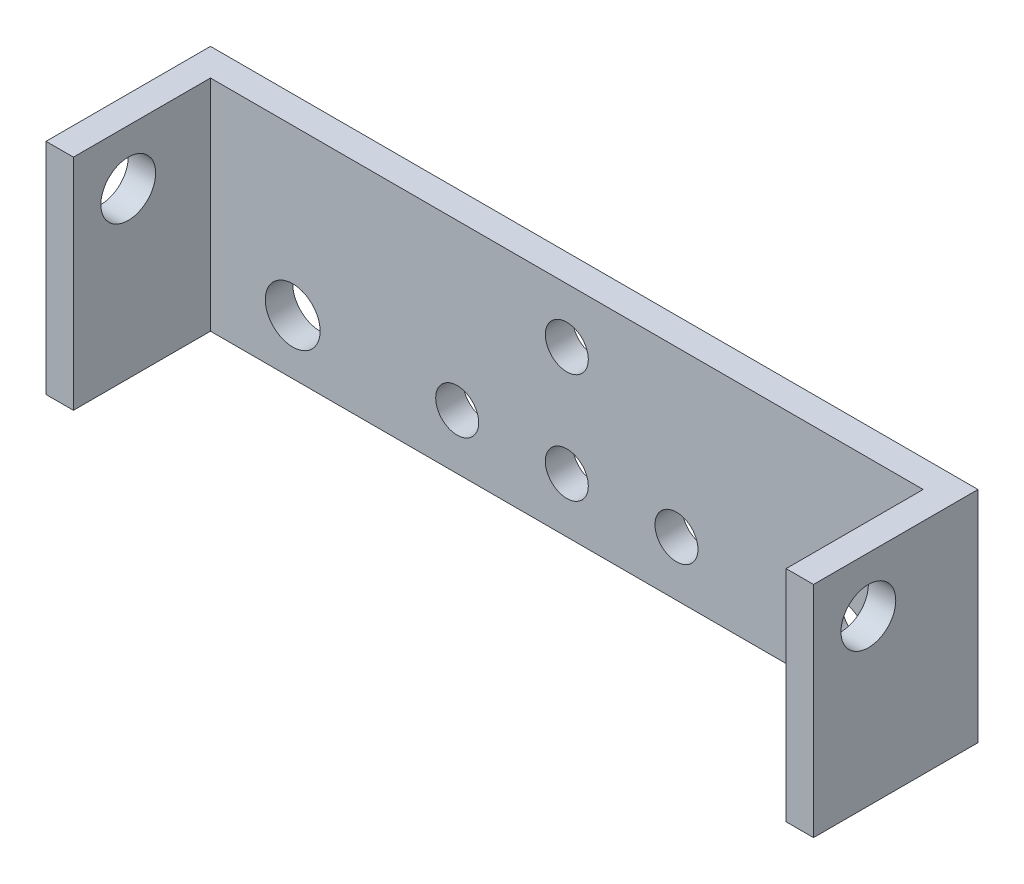
ISO-10303-21;
HEADER;
FILE_DESCRIPTION(('STEP AP214'),'2;1');
FILE_NAME('part.step','',(''),(''),'','','');
FILE_SCHEMA(('AUTOMOTIVE_DESIGN { 1 0 10303 214 1 1 1 1 }'));
ENDSEC;
DATA;
#1=APPLICATION_CONTEXT('core data for automotive mechanical design processes');
#2=APPLICATION_PROTOCOL_DEFINITION('international standard','automotive_design',2000,#1);
#3=PRODUCT_CONTEXT('',#1,'mechanical');
#4=PRODUCT('Part','Part','',(#3));
#5=PRODUCT_RELATED_PRODUCT_CATEGORY('part','',(#4));
#6=PRODUCT_DEFINITION_FORMATION('','',#4);
#7=PRODUCT_DEFINITION_CONTEXT('part definition',#1,'design');
#8=PRODUCT_DEFINITION('design','',#6,#7);
#9=PRODUCT_DEFINITION_SHAPE('','',#8);
#10=(LENGTH_UNIT() NAMED_UNIT(*) SI_UNIT(.MILLI.,.METRE.));
#11=(NAMED_UNIT(*) PLANE_ANGLE_UNIT() SI_UNIT($,.RADIAN.));
#12=(NAMED_UNIT(*) SI_UNIT($,.STERADIAN.) SOLID_ANGLE_UNIT());
#13=UNCERTAINTY_MEASURE_WITH_UNIT(LENGTH_MEASURE(1.E-05),#10,'distance_accuracy_value','');
#14=(GEOMETRIC_REPRESENTATION_CONTEXT(3) GLOBAL_UNCERTAINTY_ASSIGNED_CONTEXT((#13)) GLOBAL_UNIT_ASSIGNED_CONTEXT((#10,
#11,#12)) REPRESENTATION_CONTEXT('',''));
#15=CARTESIAN_POINT('',(0.,0.,0.));
#16=DIRECTION('',(0.,0.,1.));
#17=DIRECTION('',(1.,0.,0.));
#18=AXIS2_PLACEMENT_3D('',#15,#16,#17);
#19=CARTESIAN_POINT('',(3.17500000000001,25.4,0.));
#20=DIRECTION('',(0.,0.,-1.));
#21=DIRECTION('',(-1.,0.,0.));
#22=AXIS2_PLACEMENT_3D('',#19,#20,#21);
#23=PLANE('',#22);
#24=DIRECTION('',(1.,0.,0.));
#25=VECTOR('',#24,1.);
#26=CARTESIAN_POINT('',(3.17500000000001,0.,0.));
#27=LINE('',#26,#25);
#28=CARTESIAN_POINT('',(0.,0.,0.));
#29=VERTEX_POINT('',#28);
#30=CARTESIAN_POINT('',(3.17500000000001,0.,0.));
#31=VERTEX_POINT('',#30);
#32=EDGE_CURVE('E128',#29,#31,#27,.T.);
#33=ORIENTED_EDGE('',*,*,#32,.T.);
#34=DIRECTION('',(0.,-1.,0.));
#35=VECTOR('',#34,1.);
#36=CARTESIAN_POINT('',(3.17500000000001,25.4,0.));
#37=LINE('',#36,#35);
#38=CARTESIAN_POINT('',(3.17500000000001,25.4,0.));
#39=VERTEX_POINT('',#38);
#40=EDGE_CURVE('E11',#39,#31,#37,.T.);
#41=ORIENTED_EDGE('',*,*,#40,.F.);
#42=DIRECTION('',(1.,0.,0.));
#43=VECTOR('',#42,1.);
#44=CARTESIAN_POINT('',(3.17500000000001,25.4,0.));
#45=LINE('',#44,#43);
#46=CARTESIAN_POINT('',(0.,25.4,0.));
#47=VERTEX_POINT('',#46);
#48=EDGE_CURVE('E143',#47,#39,#45,.T.);
#49=ORIENTED_EDGE('',*,*,#48,.F.);
#50=DIRECTION('',(0.,-1.,0.));
#51=VECTOR('',#50,1.);
#52=CARTESIAN_POINT('',(0.,25.4,0.));
#53=LINE('',#52,#51);
#54=EDGE_CURVE('E124',#47,#29,#53,.T.);
#55=ORIENTED_EDGE('',*,*,#54,.T.);
#56=EDGE_LOOP('',(#33,#41,#49,#55));
#57=FACE_BOUND('',#56,.T.);
#58=ADVANCED_FACE('F32',(#57),#23,.F.);
#59=CARTESIAN_POINT('',(3.175,25.4,-15.875));
#60=DIRECTION('',(-1.,0.,0.));
#61=DIRECTION('',(0.,0.,1.));
#62=AXIS2_PLACEMENT_3D('',#59,#60,#61);
#63=PLANE('',#62);
#64=CARTESIAN_POINT('',(3.175,19.05,-6.34999999999999));
#65=DIRECTION('',(-1.,0.,0.));
#66=DIRECTION('',(0.,0.,1.));
#67=AXIS2_PLACEMENT_3D('',#64,#65,#66);
#68=CIRCLE('',#67,3.175);
#69=CARTESIAN_POINT('',(3.17500000000001,19.05,-3.17499999999999));
#70=VERTEX_POINT('',#69);
#71=EDGE_CURVE('E132',#70,#70,#68,.T.);
#72=ORIENTED_EDGE('',*,*,#71,.T.);
#73=EDGE_LOOP('',(#72));
#74=FACE_BOUND('',#73,.T.);
#75=DIRECTION('',(0.,0.,-1.));
#76=VECTOR('',#75,1.);
#77=CARTESIAN_POINT('',(3.175,0.,-15.875));
#78=LINE('',#77,#76);
#79=CARTESIAN_POINT('',(3.175,0.,-15.875));
#80=VERTEX_POINT('',#79);
#81=EDGE_CURVE('E131',#31,#80,#78,.T.);
#82=ORIENTED_EDGE('',*,*,#81,.T.);
#83=DIRECTION('',(0.,-1.,0.));
#84=VECTOR('',#83,1.);
#85=CARTESIAN_POINT('',(3.175,25.4,-15.875));
#86=LINE('',#85,#84);
#87=CARTESIAN_POINT('',(3.175,25.4,-15.875));
#88=VERTEX_POINT('',#87);
#89=EDGE_CURVE('E40',#88,#80,#86,.T.);
#90=ORIENTED_EDGE('',*,*,#89,.F.);
#91=DIRECTION('',(0.,0.,-1.));
#92=VECTOR('',#91,1.);
#93=CARTESIAN_POINT('',(3.175,25.4,-15.875));
#94=LINE('',#93,#92);
#95=EDGE_CURVE('E91',#39,#88,#94,.T.);
#96=ORIENTED_EDGE('',*,*,#95,.F.);
#97=ORIENTED_EDGE('',*,*,#40,.T.);
#98=EDGE_LOOP('',(#82,#90,#96,#97));
#99=FACE_BOUND('',#98,.T.);
#100=ADVANCED_FACE('F250',(#74,#99),#63,.F.);
#101=CARTESIAN_POINT('',(85.725,25.4,-15.875));
#102=DIRECTION('',(0.,0.,-1.));
#103=DIRECTION('',(-1.,0.,0.));
#104=AXIS2_PLACEMENT_3D('',#101,#102,#103);
#105=PLANE('',#104);
#106=CARTESIAN_POINT('',(31.75,6.35,-15.875));
#107=DIRECTION('',(0.,0.,-1.));
#108=DIRECTION('',(-1.,0.,0.));
#109=AXIS2_PLACEMENT_3D('',#106,#107,#108);
#110=CIRCLE('',#109,2.48919999999998);
#111=CARTESIAN_POINT('',(29.2608,6.35,-15.875));
#112=VERTEX_POINT('',#111);
#113=EDGE_CURVE('E204',#112,#112,#110,.T.);
#114=ORIENTED_EDGE('',*,*,#113,.T.);
#115=EDGE_LOOP('',(#114));
#116=FACE_BOUND('',#115,.T.);
#117=CARTESIAN_POINT('',(57.15,6.35,-15.875));
#118=DIRECTION('',(0.,0.,-1.));
#119=DIRECTION('',(-1.,0.,0.));
#120=AXIS2_PLACEMENT_3D('',#117,#118,#119);
#121=CIRCLE('',#120,2.4892);
#122=CARTESIAN_POINT('',(54.6608,6.35,-15.875));
#123=VERTEX_POINT('',#122);
#124=EDGE_CURVE('E214',#123,#123,#121,.T.);
#125=ORIENTED_EDGE('',*,*,#124,.T.);
#126=EDGE_LOOP('',(#125));
#127=FACE_BOUND('',#126,.T.);
#128=CARTESIAN_POINT('',(44.45,19.05,-15.875));
#129=DIRECTION('',(0.,0.,1.));
#130=DIRECTION('',(1.,0.,0.));
#131=AXIS2_PLACEMENT_3D('',#128,#129,#130);
#132=CIRCLE('',#131,2.4892);
#133=CARTESIAN_POINT('',(46.9392,19.05,-15.875));
#134=VERTEX_POINT('',#133);
#135=EDGE_CURVE('E207',#134,#134,#132,.T.);
#136=ORIENTED_EDGE('',*,*,#135,.F.);
#137=EDGE_LOOP('',(#136));
#138=FACE_BOUND('',#137,.T.);
#139=CARTESIAN_POINT('',(44.45,6.35,-15.875));
#140=DIRECTION('',(0.,0.,1.));
#141=DIRECTION('',(1.,0.,0.));
#142=AXIS2_PLACEMENT_3D('',#139,#140,#141);
#143=CIRCLE('',#142,2.4892);
#144=CARTESIAN_POINT('',(46.9392,6.35,-15.875));
#145=VERTEX_POINT('',#144);
#146=EDGE_CURVE('E200',#145,#145,#143,.T.);
#147=ORIENTED_EDGE('',*,*,#146,.F.);
#148=EDGE_LOOP('',(#147));
#149=FACE_BOUND('',#148,.T.);
#150=CARTESIAN_POINT('',(12.7,6.35,-15.875));
#151=DIRECTION('',(0.,0.,-1.));
#152=DIRECTION('',(-1.,0.,0.));
#153=AXIS2_PLACEMENT_3D('',#150,#151,#152);
#154=CIRCLE('',#153,3.175);
#155=CARTESIAN_POINT('',(9.525,6.35,-15.875));
#156=VERTEX_POINT('',#155);
#157=EDGE_CURVE('E185',#156,#156,#154,.T.);
#158=ORIENTED_EDGE('',*,*,#157,.T.);
#159=EDGE_LOOP('',(#158));
#160=FACE_BOUND('',#159,.T.);
#161=CARTESIAN_POINT('',(76.2,6.35,-15.875));
#162=DIRECTION('',(0.,0.,-1.));
#163=DIRECTION('',(-1.,0.,0.));
#164=AXIS2_PLACEMENT_3D('',#161,#162,#163);
#165=CIRCLE('',#164,3.175);
#166=CARTESIAN_POINT('',(73.025,6.35,-15.875));
#167=VERTEX_POINT('',#166);
#168=EDGE_CURVE('E190',#167,#167,#165,.T.);
#169=ORIENTED_EDGE('',*,*,#168,.T.);
#170=EDGE_LOOP('',(#169));
#171=FACE_BOUND('',#170,.T.);
#172=DIRECTION('',(1.,0.,0.));
#173=VECTOR('',#172,1.);
#174=CARTESIAN_POINT('',(85.725,0.,-15.875));
#175=LINE('',#174,#173);
#176=CARTESIAN_POINT('',(85.725,0.,-15.875));
#177=VERTEX_POINT('',#176);
#178=EDGE_CURVE('E134',#80,#177,#175,.T.);
#179=ORIENTED_EDGE('',*,*,#178,.T.);
#180=DIRECTION('',(0.,-1.,0.));
#181=VECTOR('',#180,1.);
#182=CARTESIAN_POINT('',(85.725,25.4,-15.875));
#183=LINE('',#182,#181);
#184=CARTESIAN_POINT('',(85.725,25.4,-15.875));
#185=VERTEX_POINT('',#184);
#186=EDGE_CURVE('E150',#185,#177,#183,.T.);
#187=ORIENTED_EDGE('',*,*,#186,.F.);
#188=DIRECTION('',(1.,0.,0.));
#189=VECTOR('',#188,1.);
#190=CARTESIAN_POINT('',(85.725,25.4,-15.875));
#191=LINE('',#190,#189);
#192=EDGE_CURVE('E158',#88,#185,#191,.T.);
#193=ORIENTED_EDGE('',*,*,#192,.F.);
#194=ORIENTED_EDGE('',*,*,#89,.T.);
#195=EDGE_LOOP('',(#179,#187,#193,#194));
#196=FACE_BOUND('',#195,.T.);
#197=ADVANCED_FACE('F156',(#116,#127,#138,#149,#160,#171,#196),#105,.F.);
#198=CARTESIAN_POINT('',(85.725,25.4,0.));
#199=DIRECTION('',(1.,0.,0.));
#200=DIRECTION('',(0.,0.,-1.));
#201=AXIS2_PLACEMENT_3D('',#198,#199,#200);
#202=PLANE('',#201);
#203=CARTESIAN_POINT('',(85.725,19.05,-6.35));
#204=DIRECTION('',(1.,0.,0.));
#205=DIRECTION('',(0.,0.,-1.));
#206=AXIS2_PLACEMENT_3D('',#203,#204,#205);
#207=CIRCLE('',#206,3.175);
#208=CARTESIAN_POINT('',(85.725,19.05,-9.525));
#209=VERTEX_POINT('',#208);
#210=EDGE_CURVE('E178',#209,#209,#207,.T.);
#211=ORIENTED_EDGE('',*,*,#210,.T.);
#212=EDGE_LOOP('',(#211));
#213=FACE_BOUND('',#212,.T.);
#214=DIRECTION('',(0.,0.,1.));
#215=VECTOR('',#214,1.);
#216=CARTESIAN_POINT('',(85.725,0.,0.));
#217=LINE('',#216,#215);
#218=CARTESIAN_POINT('',(85.725,0.,0.));
#219=VERTEX_POINT('',#218);
#220=EDGE_CURVE('E136',#177,#219,#217,.T.);
#221=ORIENTED_EDGE('',*,*,#220,.T.);
#222=DIRECTION('',(0.,-1.,0.));
#223=VECTOR('',#222,1.);
#224=CARTESIAN_POINT('',(85.725,25.4,0.));
#225=LINE('',#224,#223);
#226=CARTESIAN_POINT('',(85.725,25.4,0.));
#227=VERTEX_POINT('',#226);
#228=EDGE_CURVE('E147',#227,#219,#225,.T.);
#229=ORIENTED_EDGE('',*,*,#228,.F.);
#230=DIRECTION('',(0.,0.,1.));
#231=VECTOR('',#230,1.);
#232=CARTESIAN_POINT('',(85.725,25.4,0.));
#233=LINE('',#232,#231);
#234=EDGE_CURVE('E170',#185,#227,#233,.T.);
#235=ORIENTED_EDGE('',*,*,#234,.F.);
#236=ORIENTED_EDGE('',*,*,#186,.T.);
#237=EDGE_LOOP('',(#221,#229,#235,#236));
#238=FACE_BOUND('',#237,.T.);
#239=ADVANCED_FACE('F166',(#213,#238),#202,.F.);
#240=CARTESIAN_POINT('',(88.9,25.4,0.));
#241=DIRECTION('',(0.,0.,-1.));
#242=DIRECTION('',(-1.,0.,0.));
#243=AXIS2_PLACEMENT_3D('',#240,#241,#242);
#244=PLANE('',#243);
#245=DIRECTION('',(1.,0.,0.));
#246=VECTOR('',#245,1.);
#247=CARTESIAN_POINT('',(88.9,0.,0.));
#248=LINE('',#247,#246);
#249=CARTESIAN_POINT('',(88.9,0.,0.));
#250=VERTEX_POINT('',#249);
#251=EDGE_CURVE('E138',#219,#250,#248,.T.);
#252=ORIENTED_EDGE('',*,*,#251,.T.);
#253=DIRECTION('',(0.,-1.,0.));
#254=VECTOR('',#253,1.);
#255=CARTESIAN_POINT('',(88.9,25.4,0.));
#256=LINE('',#255,#254);
#257=CARTESIAN_POINT('',(88.9,25.4,0.));
#258=VERTEX_POINT('',#257);
#259=EDGE_CURVE('E119',#258,#250,#256,.T.);
#260=ORIENTED_EDGE('',*,*,#259,.F.);
#261=DIRECTION('',(1.,0.,0.));
#262=VECTOR('',#261,1.);
#263=CARTESIAN_POINT('',(88.9,25.4,0.));
#264=LINE('',#263,#262);
#265=EDGE_CURVE('E110',#227,#258,#264,.T.);
#266=ORIENTED_EDGE('',*,*,#265,.F.);
#267=ORIENTED_EDGE('',*,*,#228,.T.);
#268=EDGE_LOOP('',(#252,#260,#266,#267));
#269=FACE_BOUND('',#268,.T.);
#270=ADVANCED_FACE('F169',(#269),#244,.F.);
#271=CARTESIAN_POINT('',(88.9,25.4,-19.05));
#272=DIRECTION('',(-1.,0.,0.));
#273=DIRECTION('',(0.,0.,1.));
#274=AXIS2_PLACEMENT_3D('',#271,#272,#273);
#275=PLANE('',#274);
#276=CARTESIAN_POINT('',(88.9,19.05,-6.35));
#277=DIRECTION('',(1.,0.,0.));
#278=DIRECTION('',(0.,0.,-1.));
#279=AXIS2_PLACEMENT_3D('',#276,#277,#278);
#280=CIRCLE('',#279,3.175);
#281=CARTESIAN_POINT('',(88.9,19.05,-9.525));
#282=VERTEX_POINT('',#281);
#283=EDGE_CURVE('E182',#282,#282,#280,.T.);
#284=ORIENTED_EDGE('',*,*,#283,.F.);
#285=EDGE_LOOP('',(#284));
#286=FACE_BOUND('',#285,.T.);
#287=DIRECTION('',(0.,0.,-1.));
#288=VECTOR('',#287,1.);
#289=CARTESIAN_POINT('',(88.9,0.,-19.05));
#290=LINE('',#289,#288);
#291=CARTESIAN_POINT('',(88.9,0.,-19.05));
#292=VERTEX_POINT('',#291);
#293=EDGE_CURVE('E118',#250,#292,#290,.T.);
#294=ORIENTED_EDGE('',*,*,#293,.T.);
#295=DIRECTION('',(0.,-1.,0.));
#296=VECTOR('',#295,1.);
#297=CARTESIAN_POINT('',(88.9,25.4,-19.05));
#298=LINE('',#297,#296);
#299=CARTESIAN_POINT('',(88.9,25.4,-19.05));
#300=VERTEX_POINT('',#299);
#301=EDGE_CURVE('E115',#300,#292,#298,.T.);
#302=ORIENTED_EDGE('',*,*,#301,.F.);
#303=DIRECTION('',(0.,0.,-1.));
#304=VECTOR('',#303,1.);
#305=CARTESIAN_POINT('',(88.9,25.4,-19.05));
#306=LINE('',#305,#304);
#307=EDGE_CURVE('E104',#258,#300,#306,.T.);
#308=ORIENTED_EDGE('',*,*,#307,.F.);
#309=ORIENTED_EDGE('',*,*,#259,.T.);
#310=EDGE_LOOP('',(#294,#302,#308,#309));
#311=FACE_BOUND('',#310,.T.);
#312=ADVANCED_FACE('F116',(#286,#311),#275,.F.);
#313=CARTESIAN_POINT('',(0.,25.4,-19.05));
#314=DIRECTION('',(0.,0.,1.));
#315=DIRECTION('',(1.,0.,0.));
#316=AXIS2_PLACEMENT_3D('',#313,#314,#315);
#317=PLANE('',#316);
#318=CARTESIAN_POINT('',(31.75,6.35,-19.05));
#319=DIRECTION('',(0.,0.,-1.));
#320=DIRECTION('',(-1.,0.,0.));
#321=AXIS2_PLACEMENT_3D('',#318,#319,#320);
#322=CIRCLE('',#321,2.48919999999998);
#323=CARTESIAN_POINT('',(29.2608,6.35,-19.05));
#324=VERTEX_POINT('',#323);
#325=EDGE_CURVE('E217',#324,#324,#322,.T.);
#326=ORIENTED_EDGE('',*,*,#325,.F.);
#327=EDGE_LOOP('',(#326));
#328=FACE_BOUND('',#327,.T.);
#329=CARTESIAN_POINT('',(57.15,6.35,-19.05));
#330=DIRECTION('',(0.,0.,-1.));
#331=DIRECTION('',(1.,0.,0.));
#332=AXIS2_PLACEMENT_3D('',#329,#330,#331);
#333=CIRCLE('',#332,2.4892);
#334=CARTESIAN_POINT('',(59.6392,6.35,-19.05));
#335=VERTEX_POINT('',#334);
#336=EDGE_CURVE('E218',#335,#335,#333,.T.);
#337=ORIENTED_EDGE('',*,*,#336,.F.);
#338=EDGE_LOOP('',(#337));
#339=FACE_BOUND('',#338,.T.);
#340=CARTESIAN_POINT('',(44.45,19.05,-19.05));
#341=DIRECTION('',(0.,0.,1.));
#342=DIRECTION('',(1.,0.,0.));
#343=AXIS2_PLACEMENT_3D('',#340,#341,#342);
#344=CIRCLE('',#343,2.4892);
#345=CARTESIAN_POINT('',(46.9392,19.05,-19.05));
#346=VERTEX_POINT('',#345);
#347=EDGE_CURVE('E197',#346,#346,#344,.T.);
#348=ORIENTED_EDGE('',*,*,#347,.T.);
#349=EDGE_LOOP('',(#348));
#350=FACE_BOUND('',#349,.T.);
#351=CARTESIAN_POINT('',(44.45,6.35,-19.05));
#352=DIRECTION('',(0.,0.,1.));
#353=DIRECTION('',(1.,0.,0.));
#354=AXIS2_PLACEMENT_3D('',#351,#352,#353);
#355=CIRCLE('',#354,2.4892);
#356=CARTESIAN_POINT('',(46.9392,6.35,-19.05));
#357=VERTEX_POINT('',#356);
#358=EDGE_CURVE('E203',#357,#357,#355,.T.);
#359=ORIENTED_EDGE('',*,*,#358,.T.);
#360=EDGE_LOOP('',(#359));
#361=FACE_BOUND('',#360,.T.);
#362=CARTESIAN_POINT('',(12.7,6.35,-19.05));
#363=DIRECTION('',(0.,0.,1.));
#364=DIRECTION('',(1.,0.,0.));
#365=AXIS2_PLACEMENT_3D('',#362,#363,#364);
#366=CIRCLE('',#365,3.175);
#367=CARTESIAN_POINT('',(15.875,6.35,-19.05));
#368=VERTEX_POINT('',#367);
#369=EDGE_CURVE('E193',#368,#368,#366,.T.);
#370=ORIENTED_EDGE('',*,*,#369,.T.);
#371=EDGE_LOOP('',(#370));
#372=FACE_BOUND('',#371,.T.);
#373=CARTESIAN_POINT('',(76.2,6.35,-19.05));
#374=DIRECTION('',(0.,0.,1.));
#375=DIRECTION('',(1.,0.,0.));
#376=AXIS2_PLACEMENT_3D('',#373,#374,#375);
#377=CIRCLE('',#376,3.175);
#378=CARTESIAN_POINT('',(79.375,6.35,-19.05));
#379=VERTEX_POINT('',#378);
#380=EDGE_CURVE('E194',#379,#379,#377,.T.);
#381=ORIENTED_EDGE('',*,*,#380,.T.);
#382=EDGE_LOOP('',(#381));
#383=FACE_BOUND('',#382,.T.);
#384=DIRECTION('',(-1.,0.,0.));
#385=VECTOR('',#384,1.);
#386=CARTESIAN_POINT('',(0.,0.,-19.05));
#387=LINE('',#386,#385);
#388=CARTESIAN_POINT('',(0.,0.,-19.05));
#389=VERTEX_POINT('',#388);
#390=EDGE_CURVE('E77',#292,#389,#387,.T.);
#391=ORIENTED_EDGE('',*,*,#390,.T.);
#392=DIRECTION('',(0.,-1.,0.));
#393=VECTOR('',#392,1.);
#394=CARTESIAN_POINT('',(0.,25.4,-19.05));
#395=LINE('',#394,#393);
#396=CARTESIAN_POINT('',(0.,25.4,-19.05));
#397=VERTEX_POINT('',#396);
#398=EDGE_CURVE('E120',#397,#389,#395,.T.);
#399=ORIENTED_EDGE('',*,*,#398,.F.);
#400=DIRECTION('',(-1.,0.,0.));
#401=VECTOR('',#400,1.);
#402=CARTESIAN_POINT('',(0.,25.4,-19.05));
#403=LINE('',#402,#401);
#404=EDGE_CURVE('E108',#300,#397,#403,.T.);
#405=ORIENTED_EDGE('',*,*,#404,.F.);
#406=ORIENTED_EDGE('',*,*,#301,.T.);
#407=EDGE_LOOP('',(#391,#399,#405,#406));
#408=FACE_BOUND('',#407,.T.);
#409=ADVANCED_FACE('F122',(#328,#339,#350,#361,#372,#383,#408),#317,.F.);
#410=CARTESIAN_POINT('',(0.,25.4,0.));
#411=DIRECTION('',(1.,0.,0.));
#412=DIRECTION('',(0.,0.,-1.));
#413=AXIS2_PLACEMENT_3D('',#410,#411,#412);
#414=PLANE('',#413);
#415=CARTESIAN_POINT('',(0.,19.05,-6.34999999999999));
#416=DIRECTION('',(1.,0.,0.));
#417=DIRECTION('',(0.,0.,-1.));
#418=AXIS2_PLACEMENT_3D('',#415,#416,#417);
#419=CIRCLE('',#418,3.175);
#420=CARTESIAN_POINT('',(0.,19.05,-9.52499999999998));
#421=VERTEX_POINT('',#420);
#422=EDGE_CURVE('E181',#421,#421,#419,.T.);
#423=ORIENTED_EDGE('',*,*,#422,.T.);
#424=EDGE_LOOP('',(#423));
#425=FACE_BOUND('',#424,.T.);
#426=DIRECTION('',(0.,0.,1.));
#427=VECTOR('',#426,1.);
#428=CARTESIAN_POINT('',(0.,0.,0.));
#429=LINE('',#428,#427);
#430=EDGE_CURVE('E83',#389,#29,#429,.T.);
#431=ORIENTED_EDGE('',*,*,#430,.T.);
#432=ORIENTED_EDGE('',*,*,#54,.F.);
#433=DIRECTION('',(0.,0.,1.));
#434=VECTOR('',#433,1.);
#435=CARTESIAN_POINT('',(0.,25.4,0.));
#436=LINE('',#435,#434);
#437=EDGE_CURVE('E48',#397,#47,#436,.T.);
#438=ORIENTED_EDGE('',*,*,#437,.F.);
#439=ORIENTED_EDGE('',*,*,#398,.T.);
#440=EDGE_LOOP('',(#431,#432,#438,#439));
#441=FACE_BOUND('',#440,.T.);
#442=ADVANCED_FACE('F229',(#425,#441),#414,.F.);
#443=CARTESIAN_POINT('',(0.,25.4,0.));
#444=DIRECTION('',(0.,-1.,0.));
#445=DIRECTION('',(0.,0.,-1.));
#446=AXIS2_PLACEMENT_3D('',#443,#444,#445);
#447=PLANE('',#446);
#448=ORIENTED_EDGE('',*,*,#48,.T.);
#449=ORIENTED_EDGE('',*,*,#95,.T.);
#450=ORIENTED_EDGE('',*,*,#192,.T.);
#451=ORIENTED_EDGE('',*,*,#234,.T.);
#452=ORIENTED_EDGE('',*,*,#265,.T.);
#453=ORIENTED_EDGE('',*,*,#307,.T.);
#454=ORIENTED_EDGE('',*,*,#404,.T.);
#455=ORIENTED_EDGE('',*,*,#437,.T.);
#456=EDGE_LOOP('',(#448,#449,#450,#451,#452,#453,#454,#455));
#457=FACE_BOUND('',#456,.T.);
#458=ADVANCED_FACE('F106',(#457),#447,.F.);
#459=CARTESIAN_POINT('',(0.,0.,0.));
#460=DIRECTION('',(0.,-1.,0.));
#461=DIRECTION('',(0.,0.,-1.));
#462=AXIS2_PLACEMENT_3D('',#459,#460,#461);
#463=PLANE('',#462);
#464=ORIENTED_EDGE('',*,*,#32,.F.);
#465=ORIENTED_EDGE('',*,*,#430,.F.);
#466=ORIENTED_EDGE('',*,*,#390,.F.);
#467=ORIENTED_EDGE('',*,*,#293,.F.);
#468=ORIENTED_EDGE('',*,*,#251,.F.);
#469=ORIENTED_EDGE('',*,*,#220,.F.);
#470=ORIENTED_EDGE('',*,*,#178,.F.);
#471=ORIENTED_EDGE('',*,*,#81,.F.);
#472=EDGE_LOOP('',(#464,#465,#466,#467,#468,#469,#470,#471));
#473=FACE_BOUND('',#472,.T.);
#474=ADVANCED_FACE('F162',(#473),#463,.T.);
#475=CARTESIAN_POINT('',(0.,19.05,-6.34999999999999));
#476=DIRECTION('',(1.,0.,0.));
#477=DIRECTION('',(0.,0.,-1.));
#478=AXIS2_PLACEMENT_3D('',#475,#476,#477);
#479=CYLINDRICAL_SURFACE('',#478,3.175);
#480=ORIENTED_EDGE('',*,*,#422,.F.);
#481=EDGE_LOOP('',(#480));
#482=FACE_BOUND('',#481,.T.);
#483=ORIENTED_EDGE('',*,*,#71,.F.);
#484=EDGE_LOOP('',(#483));
#485=FACE_BOUND('',#484,.T.);
#486=ADVANCED_FACE('F332',(#482,#485),#479,.F.);
#487=ORIENTED_EDGE('',*,*,#283,.T.);
#488=EDGE_LOOP('',(#487));
#489=FACE_BOUND('',#488,.T.);
#490=ORIENTED_EDGE('',*,*,#210,.F.);
#491=EDGE_LOOP('',(#490));
#492=FACE_BOUND('',#491,.T.);
#493=ADVANCED_FACE('F245',(#489,#492),#479,.F.);
#494=CARTESIAN_POINT('',(76.2,6.35,-19.05));
#495=DIRECTION('',(0.,0.,1.));
#496=DIRECTION('',(1.,0.,0.));
#497=AXIS2_PLACEMENT_3D('',#494,#495,#496);
#498=CYLINDRICAL_SURFACE('',#497,3.175);
#499=ORIENTED_EDGE('',*,*,#380,.F.);
#500=EDGE_LOOP('',(#499));
#501=FACE_BOUND('',#500,.T.);
#502=ORIENTED_EDGE('',*,*,#168,.F.);
#503=EDGE_LOOP('',(#502));
#504=FACE_BOUND('',#503,.T.);
#505=ADVANCED_FACE('F241',(#501,#504),#498,.F.);
#506=CARTESIAN_POINT('',(12.7,6.35,-19.05));
#507=DIRECTION('',(0.,0.,1.));
#508=DIRECTION('',(1.,0.,0.));
#509=AXIS2_PLACEMENT_3D('',#506,#507,#508);
#510=CYLINDRICAL_SURFACE('',#509,3.175);
#511=ORIENTED_EDGE('',*,*,#369,.F.);
#512=EDGE_LOOP('',(#511));
#513=FACE_BOUND('',#512,.T.);
#514=ORIENTED_EDGE('',*,*,#157,.F.);
#515=EDGE_LOOP('',(#514));
#516=FACE_BOUND('',#515,.T.);
#517=ADVANCED_FACE('F244',(#513,#516),#510,.F.);
#518=CARTESIAN_POINT('',(44.45,6.35,-19.05));
#519=DIRECTION('',(0.,0.,1.));
#520=DIRECTION('',(1.,0.,0.));
#521=AXIS2_PLACEMENT_3D('',#518,#519,#520);
#522=CYLINDRICAL_SURFACE('',#521,2.4892);
#523=ORIENTED_EDGE('',*,*,#358,.F.);
#524=EDGE_LOOP('',(#523));
#525=FACE_BOUND('',#524,.T.);
#526=ORIENTED_EDGE('',*,*,#146,.T.);
#527=EDGE_LOOP('',(#526));
#528=FACE_BOUND('',#527,.T.);
#529=ADVANCED_FACE('F324',(#525,#528),#522,.F.);
#530=CARTESIAN_POINT('',(44.45,19.05,-19.05));
#531=DIRECTION('',(0.,0.,1.));
#532=DIRECTION('',(1.,0.,0.));
#533=AXIS2_PLACEMENT_3D('',#530,#531,#532);
#534=CYLINDRICAL_SURFACE('',#533,2.4892);
#535=ORIENTED_EDGE('',*,*,#347,.F.);
#536=EDGE_LOOP('',(#535));
#537=FACE_BOUND('',#536,.T.);
#538=ORIENTED_EDGE('',*,*,#135,.T.);
#539=EDGE_LOOP('',(#538));
#540=FACE_BOUND('',#539,.T.);
#541=ADVANCED_FACE('F307',(#537,#540),#534,.F.);
#542=CARTESIAN_POINT('',(57.15,6.35,0.));
#543=DIRECTION('',(0.,0.,-1.));
#544=DIRECTION('',(-1.,0.,0.));
#545=AXIS2_PLACEMENT_3D('',#542,#543,#544);
#546=CYLINDRICAL_SURFACE('',#545,2.4892);
#547=ORIENTED_EDGE('',*,*,#336,.T.);
#548=EDGE_LOOP('',(#547));
#549=FACE_BOUND('',#548,.T.);
#550=ORIENTED_EDGE('',*,*,#124,.F.);
#551=EDGE_LOOP('',(#550));
#552=FACE_BOUND('',#551,.T.);
#553=ADVANCED_FACE('F302',(#549,#552),#546,.F.);
#554=CARTESIAN_POINT('',(31.75,6.35,0.));
#555=DIRECTION('',(0.,0.,-1.));
#556=DIRECTION('',(-1.,0.,0.));
#557=AXIS2_PLACEMENT_3D('',#554,#555,#556);
#558=CYLINDRICAL_SURFACE('',#557,2.48919999999998);
#559=ORIENTED_EDGE('',*,*,#325,.T.);
#560=EDGE_LOOP('',(#559));
#561=FACE_BOUND('',#560,.T.);
#562=ORIENTED_EDGE('',*,*,#113,.F.);
#563=EDGE_LOOP('',(#562));
#564=FACE_BOUND('',#563,.T.);
#565=ADVANCED_FACE('F224',(#561,#564),#558,.F.);
#566=CLOSED_SHELL('',(#58,#100,#197,#239,#270,#312,#409,#442,#458,#474,#486,#493,#505,#517,#529,
#541,#553,#565));
#567=MANIFOLD_SOLID_BREP('B2',#566);
#568=ADVANCED_BREP_SHAPE_REPRESENTATION('',(#18,#567),#14);
#569=SHAPE_DEFINITION_REPRESENTATION(#9,#568);
ENDSEC;
END-ISO-10303-21;
